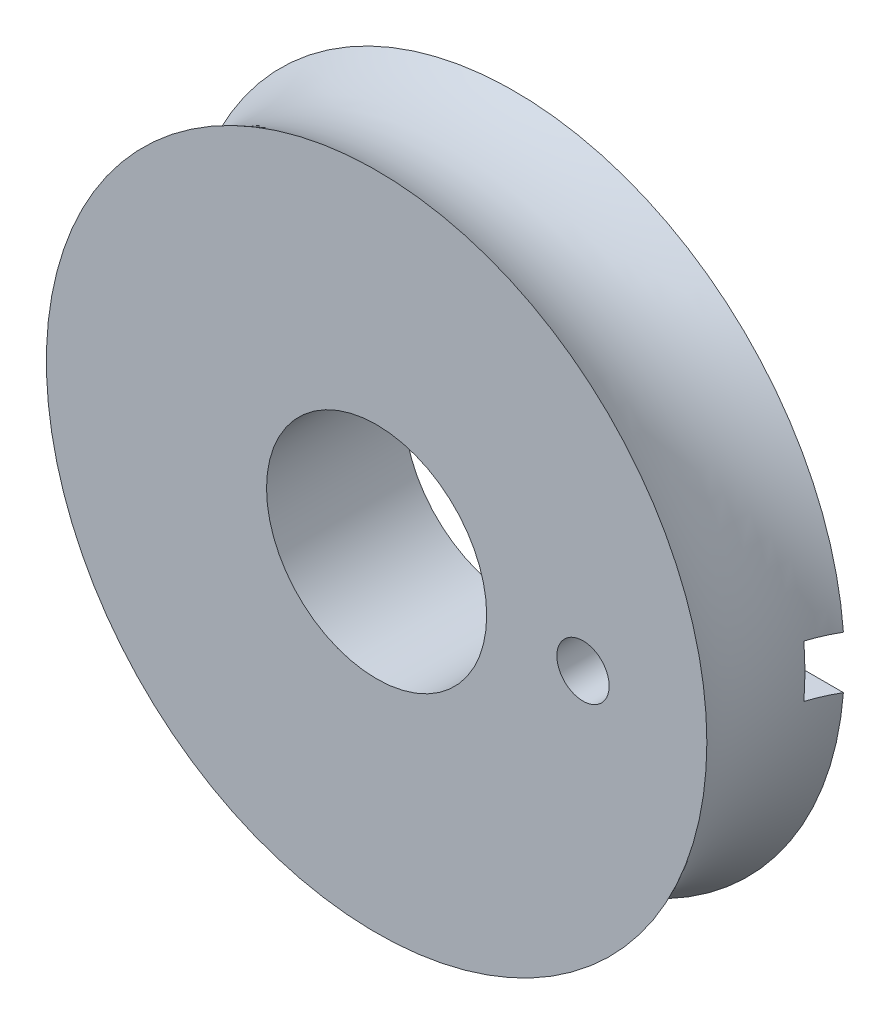
ISO-10303-21;
HEADER;
FILE_DESCRIPTION(('STEP AP214'),'2;1');
FILE_NAME('part.step','',(''),(''),'','','');
FILE_SCHEMA(('AUTOMOTIVE_DESIGN { 1 0 10303 214 1 1 1 1 }'));
ENDSEC;
DATA;
#1=APPLICATION_CONTEXT('core data for automotive mechanical design processes');
#2=APPLICATION_PROTOCOL_DEFINITION('international standard','automotive_design',2000,#1);
#3=PRODUCT_CONTEXT('',#1,'mechanical');
#4=PRODUCT('Part','Part','',(#3));
#5=PRODUCT_RELATED_PRODUCT_CATEGORY('part','',(#4));
#6=PRODUCT_DEFINITION_FORMATION('','',#4);
#7=PRODUCT_DEFINITION_CONTEXT('part definition',#1,'design');
#8=PRODUCT_DEFINITION('design','',#6,#7);
#9=PRODUCT_DEFINITION_SHAPE('','',#8);
#10=(LENGTH_UNIT() NAMED_UNIT(*) SI_UNIT(.MILLI.,.METRE.));
#11=(NAMED_UNIT(*) PLANE_ANGLE_UNIT() SI_UNIT($,.RADIAN.));
#12=(NAMED_UNIT(*) SI_UNIT($,.STERADIAN.) SOLID_ANGLE_UNIT());
#13=UNCERTAINTY_MEASURE_WITH_UNIT(LENGTH_MEASURE(1.E-05),#10,'distance_accuracy_value','');
#14=(GEOMETRIC_REPRESENTATION_CONTEXT(3) GLOBAL_UNCERTAINTY_ASSIGNED_CONTEXT((#13)) GLOBAL_UNIT_ASSIGNED_CONTEXT((#10,
#11,#12)) REPRESENTATION_CONTEXT('',''));
#15=CARTESIAN_POINT('',(0.,0.,0.));
#16=DIRECTION('',(0.,0.,1.));
#17=DIRECTION('',(1.,0.,0.));
#18=AXIS2_PLACEMENT_3D('',#15,#16,#17);
#19=CARTESIAN_POINT('',(0.,0.,0.));
#20=DIRECTION('',(0.,0.,1.));
#21=DIRECTION('',(1.,0.,0.));
#22=AXIS2_PLACEMENT_3D('',#19,#20,#21);
#23=PLANE('',#22);
#24=CARTESIAN_POINT('',(7.5,0.,0.));
#25=DIRECTION('',(0.,0.,-1.));
#26=DIRECTION('',(-1.,0.,0.));
#27=AXIS2_PLACEMENT_3D('',#24,#25,#26);
#28=CIRCLE('',#27,0.95);
#29=CARTESIAN_POINT('',(6.55,0.,0.));
#30=VERTEX_POINT('',#29);
#31=EDGE_CURVE('E154',#30,#30,#28,.T.);
#32=ORIENTED_EDGE('',*,*,#31,.T.);
#33=EDGE_LOOP('',(#32));
#34=FACE_BOUND('',#33,.T.);
#35=CARTESIAN_POINT('',(0.,0.,0.));
#36=DIRECTION('',(0.,0.,1.));
#37=DIRECTION('',(1.,0.,0.));
#38=AXIS2_PLACEMENT_3D('',#35,#36,#37);
#39=CIRCLE('',#38,4.);
#40=CARTESIAN_POINT('',(4.,0.,0.));
#41=VERTEX_POINT('',#40);
#42=EDGE_CURVE('E158',#41,#41,#39,.T.);
#43=ORIENTED_EDGE('',*,*,#42,.F.);
#44=EDGE_LOOP('',(#43));
#45=FACE_BOUND('',#44,.T.);
#46=CARTESIAN_POINT('',(0.,0.,0.));
#47=DIRECTION('',(0.,0.,1.));
#48=DIRECTION('',(1.,0.,0.));
#49=AXIS2_PLACEMENT_3D('',#46,#47,#48);
#50=CIRCLE('',#49,12.);
#51=CARTESIAN_POINT('',(12.,0.,0.));
#52=VERTEX_POINT('',#51);
#53=EDGE_CURVE('E51',#52,#52,#50,.T.);
#54=ORIENTED_EDGE('',*,*,#53,.T.);
#55=EDGE_LOOP('',(#54));
#56=FACE_BOUND('',#55,.T.);
#57=ADVANCED_FACE('F43',(#34,#45,#56),#23,.T.);
#58=CARTESIAN_POINT('',(0.,0.,-2.5));
#59=DIRECTION('',(0.,0.,1.));
#60=DIRECTION('',(1.,0.,0.));
#61=AXIS2_PLACEMENT_3D('',#58,#59,#60);
#62=TOROIDAL_SURFACE('',#61,16.3301270189222,5.);
#63=CARTESIAN_POINT('',(16.6099722286464,0.95,-7.49056678825223));
#64=CARTESIAN_POINT('',(16.4690856211627,0.95,-7.49923427007496));
#65=CARTESIAN_POINT('',(16.3278344244508,0.95,-7.5019251202439));
#66=CARTESIAN_POINT('',(16.0456139038778,0.95,-7.49540420740135));
#67=CARTESIAN_POINT('',(15.9046445659456,0.95,-7.48619305422756));
#68=CARTESIAN_POINT('',(15.6240831041017,0.95,-7.45593033397462));
#69=CARTESIAN_POINT('',(15.4844900793214,0.95,-7.43488711894718));
#70=CARTESIAN_POINT('',(15.2075730803796,0.95,-7.38112275664109));
#71=CARTESIAN_POINT('',(15.0702490813083,0.95,-7.34840173765229));
#72=CARTESIAN_POINT('',(14.7988070382839,0.95,-7.27150344620997));
#73=CARTESIAN_POINT('',(14.6646898679316,0.95,-7.22732308999076));
#74=CARTESIAN_POINT('',(14.4006038506592,0.95,-7.12780604850254));
#75=CARTESIAN_POINT('',(14.2706365548161,0.95,-7.07246524710585));
#76=CARTESIAN_POINT('',(14.015897288491,0.95,-6.95106322844596));
#77=CARTESIAN_POINT('',(13.8911224928323,0.95,-6.88500793922445));
#78=CARTESIAN_POINT('',(13.647535059338,0.95,-6.7425959385003));
#79=CARTESIAN_POINT('',(13.5287246385344,0.95,-6.66623543475621));
#80=CARTESIAN_POINT('',(13.297994998553,0.95,-6.5037940511035));
#81=CARTESIAN_POINT('',(13.1860738795521,0.95,-6.41771586970767));
#82=CARTESIAN_POINT('',(12.9698469392136,0.95,-6.23639652543564));
#83=CARTESIAN_POINT('',(12.8655439487237,0.95,-6.14115198656342));
#84=CARTESIAN_POINT('',(12.665371450766,0.95,-5.94222451963951));
#85=CARTESIAN_POINT('',(12.5694999246896,0.95,-5.83854362287484));
#86=CARTESIAN_POINT('',(12.3868186502065,0.95,-5.62341797101158));
#87=CARTESIAN_POINT('',(12.3000122552596,0.95,-5.51197036802029));
#88=CARTESIAN_POINT('',(12.1362926945604,0.95,-5.2823650891307));
#89=CARTESIAN_POINT('',(12.0593602237172,0.95,-5.16422117864825));
#90=CARTESIAN_POINT('',(11.9157173785261,0.95,-4.92181523280993));
#91=CARTESIAN_POINT('',(11.8490107908879,0.95,-4.79755095344081));
#92=CARTESIAN_POINT('',(11.7263645241591,0.95,-4.54387900555786));
#93=CARTESIAN_POINT('',(11.6704205135286,0.95,-4.4144734316313));
#94=CARTESIAN_POINT('',(11.5696560417951,0.95,-4.15134925185179));
#95=CARTESIAN_POINT('',(11.5248396826375,0.95,-4.01762907598657));
#96=CARTESIAN_POINT('',(11.4468182761218,0.95,-3.74731626172265));
#97=CARTESIAN_POINT('',(11.4135750033541,0.95,-3.61073469029973));
#98=CARTESIAN_POINT('',(11.358721881655,0.95,-3.33524110723653));
#99=CARTESIAN_POINT('',(11.3371163366668,0.95,-3.19632825298269));
#100=CARTESIAN_POINT('',(11.2900766665793,0.95,-2.77769517325149));
#101=CARTESIAN_POINT('',(11.2823295190018,0.95,-2.49576768339198));
#102=CARTESIAN_POINT('',(11.3143754784574,0.95,-1.93544305569458));
#103=CARTESIAN_POINT('',(11.3540588963338,0.95,-1.65703927124092));
#104=CARTESIAN_POINT('',(11.479589436482,0.95,-1.11080942822649));
#105=CARTESIAN_POINT('',(11.5654315759903,0.95,-0.842982231288412));
#106=CARTESIAN_POINT('',(11.762252549476,0.95,-0.370024981867192));
#107=CARTESIAN_POINT('',(11.8663828220489,0.95,-0.162026626241924));
#108=CARTESIAN_POINT('',(12.0433334961672,0.95,0.137456885273732));
#109=CARTESIAN_POINT('',(12.1057700766582,0.95,0.23519127697452));
#110=CARTESIAN_POINT('',(12.23728524194,0.95,0.426104183005245));
#111=CARTESIAN_POINT('',(12.3063647477378,0.95,0.519282062889144));
#112=CARTESIAN_POINT('',(12.3786182842567,0.95,0.609972228646443));
#113=B_SPLINE_CURVE_WITH_KNOTS('',3,(#63,#64,#65,#66,#67,#68,#69,#70,#71,#72,#73,#74,#75,#76,
#77,#78,#79,#80,#81,#82,#83,#84,#85,#86,#87,#88,#89,#90,#91,#92,#93,#94,#95,#96,#97,#98,#99,
#100,#101,#102,#103,#104,#105,#106,#107,#108,#109,#110,#111,#112),.UNSPECIFIED.,.F.,.F.,(4,2,2,
2,2,2,2,2,2,2,2,2,2,2,2,2,2,2,2,2,2,2,2,2,4),(0.,0.423329137291033,0.846636584802267,
1.26964560121558,1.69264997068571,2.11576829109022,2.53904294975978,2.96208421562806,
3.38528158416787,3.80836172228918,4.23159828275148,4.65473323713003,5.07802417122917,
5.5004744708454,5.92308083056536,6.34551674937264,6.76810815876421,7.18929022048912,
7.61062793985432,8.4523394299958,9.29210811682564,10.1317861700992,10.8272624716086,
11.1749415265617,11.5226688550988),.UNSPECIFIED.);
#114=CARTESIAN_POINT('',(11.9623367282484,0.95,-5.));
#115=VERTEX_POINT('',#114);
#116=CARTESIAN_POINT('',(11.5213308770929,0.95,-4.));
#117=VERTEX_POINT('',#116);
#118=EDGE_CURVE('E93',#115,#117,#113,.T.);
#119=ORIENTED_EDGE('',*,*,#118,.F.);
#120=CARTESIAN_POINT('',(0.,0.,-5.));
#121=DIRECTION('',(0.,0.,1.));
#122=DIRECTION('',(1.,0.,0.));
#123=AXIS2_PLACEMENT_3D('',#120,#121,#122);
#124=CIRCLE('',#123,12.);
#125=CARTESIAN_POINT('',(11.9623367282484,-0.95,-5.));
#126=VERTEX_POINT('',#125);
#127=EDGE_CURVE('E163',#115,#126,#124,.T.);
#128=ORIENTED_EDGE('',*,*,#127,.T.);
#129=CARTESIAN_POINT('',(12.3786182842567,-0.95,0.609972228646444));
#130=CARTESIAN_POINT('',(12.2910903214755,-0.95,0.500131405212451));
#131=CARTESIAN_POINT('',(12.2082091069875,-0.95,0.386590198513671));
#132=CARTESIAN_POINT('',(12.0522838430119,-0.95,0.152947889496803));
#133=CARTESIAN_POINT('',(11.9792394818985,-0.95,0.0328469951553883));
#134=CARTESIAN_POINT('',(11.8435677735349,-0.95,-0.213005146384381));
#135=CARTESIAN_POINT('',(11.7809340376919,-0.95,-0.338752867712755));
#136=CARTESIAN_POINT('',(11.6664793692499,-0.95,-0.595074089997886));
#137=CARTESIAN_POINT('',(11.6146582569239,-0.95,-0.725647510699612));
#138=CARTESIAN_POINT('',(11.5221882633574,-0.95,-0.990746746520783));
#139=CARTESIAN_POINT('',(11.4815435249747,-0.95,-1.12527400685157));
#140=CARTESIAN_POINT('',(11.4117355444093,-0.95,-1.39732844735223));
#141=CARTESIAN_POINT('',(11.382576550556,-0.95,-1.53485671771803));
#142=CARTESIAN_POINT('',(11.3359895581455,-0.95,-1.81180092900116));
#143=CARTESIAN_POINT('',(11.3185545114975,-0.95,-1.95121568429713));
#144=CARTESIAN_POINT('',(11.2955111267111,-0.95,-2.23107115704392));
#145=CARTESIAN_POINT('',(11.2899071496162,-0.95,-2.37151223367198));
#146=CARTESIAN_POINT('',(11.2905793697296,-0.95,-2.65205520503905));
#147=CARTESIAN_POINT('',(11.2968293382758,-0.95,-2.79215716342164));
#148=CARTESIAN_POINT('',(11.321116371386,-0.95,-3.07138780553821));
#149=CARTESIAN_POINT('',(11.3391577817453,-0.95,-3.21051611131255));
#150=CARTESIAN_POINT('',(11.3868943381546,-0.95,-3.48672620212138));
#151=CARTESIAN_POINT('',(11.4165868444923,-0.95,-3.6238084434218));
#152=CARTESIAN_POINT('',(11.487421958212,-0.95,-3.89503598865364));
#153=CARTESIAN_POINT('',(11.5285687941854,-0.95,-4.02918018818352));
#154=CARTESIAN_POINT('',(11.6219838238937,-0.95,-4.29345949970675));
#155=CARTESIAN_POINT('',(11.6742461957451,-0.95,-4.4235966697363));
#156=CARTESIAN_POINT('',(11.7895475182244,-0.95,-4.67906344340828));
#157=CARTESIAN_POINT('',(11.8525904339646,-0.95,-4.80439125731602));
#158=CARTESIAN_POINT('',(11.9889592530993,-0.95,-5.04925916816724));
#159=CARTESIAN_POINT('',(12.0622812119643,-0.95,-5.16880146171281));
#160=CARTESIAN_POINT('',(12.2187261020892,-0.95,-5.40135164987128));
#161=CARTESIAN_POINT('',(12.3018526487991,-0.95,-5.51435711098381));
#162=CARTESIAN_POINT('',(12.4774985157544,-0.95,-5.73324503296186));
#163=CARTESIAN_POINT('',(12.5700384086748,-0.95,-5.83911101360963));
#164=CARTESIAN_POINT('',(12.7636879337416,-0.95,-6.04271140425752));
#165=CARTESIAN_POINT('',(12.8648007237773,-0.95,-6.14044279132059));
#166=CARTESIAN_POINT('',(13.179876028395,-0.95,-6.42028086258136));
#167=CARTESIAN_POINT('',(13.4057711811253,-0.95,-6.58927483642713));
#168=CARTESIAN_POINT('',(13.8832316614041,-0.95,-6.88745738317094));
#169=CARTESIAN_POINT('',(14.1348718449736,-0.95,-7.01652522279053));
#170=CARTESIAN_POINT('',(14.6562503413705,-0.95,-7.23066377131985));
#171=CARTESIAN_POINT('',(14.9259865891247,-0.95,-7.315739490874));
#172=CARTESIAN_POINT('',(15.431648892815,-0.95,-7.42951582745704));
#173=CARTESIAN_POINT('',(15.6660444200505,-0.95,-7.46507780210152));
#174=CARTESIAN_POINT('',(16.0194335809589,-0.95,-7.49340601727855));
#175=CARTESIAN_POINT('',(16.1375287316119,-0.95,-7.49867966451798));
#176=CARTESIAN_POINT('',(16.3738139107004,-0.95,-7.50088377767255));
#177=CARTESIAN_POINT('',(16.4920039503697,-0.95,-7.49781303928592));
#178=CARTESIAN_POINT('',(16.6099722286464,-0.95,-7.49056678825223));
#179=B_SPLINE_CURVE_WITH_KNOTS('',3,(#129,#130,#131,#132,#133,#134,#135,#136,#137,#138,#139,
#140,#141,#142,#143,#144,#145,#146,#147,#148,#149,#150,#151,#152,#153,#154,#155,#156,#157,#158,
#159,#160,#161,#162,#163,#164,#165,#166,#167,#168,#169,#170,#171,#172,#173,#174,#175,#176,#177,
#178),.UNSPECIFIED.,.F.,.F.,(4,2,2,2,2,2,2,2,2,2,2,2,2,2,2,2,2,2,2,2,2,2,2,2,4),(0.,
0.421222785962442,0.842432224686054,1.26338222166934,1.6843252210833,2.10542404592739,
2.5266784802296,2.94767944186855,3.36883556135125,3.7890608957114,4.20944119364191,
4.62972630371103,5.05016677653642,5.47038757897724,5.89076327347846,6.31097809033156,
6.73134834906747,7.15265790522582,7.57412333374975,8.41612902300512,9.26065652388813,
10.1050878130039,10.8138505287042,11.1682286225732,11.5226578647062),.UNSPECIFIED.);
#180=CARTESIAN_POINT('',(11.5213308770929,-0.95,-4.));
#181=VERTEX_POINT('',#180);
#182=EDGE_CURVE('E104',#181,#126,#179,.T.);
#183=ORIENTED_EDGE('',*,*,#182,.F.);
#184=CARTESIAN_POINT('',(0.,0.,-4.));
#185=DIRECTION('',(0.,0.,1.));
#186=DIRECTION('',(1.,0.,0.));
#187=AXIS2_PLACEMENT_3D('',#184,#185,#186);
#188=CIRCLE('',#187,11.5604310118375);
#189=EDGE_CURVE('E65',#181,#117,#188,.T.);
#190=ORIENTED_EDGE('',*,*,#189,.T.);
#191=EDGE_LOOP('',(#119,#128,#183,#190));
#192=FACE_BOUND('',#191,.T.);
#193=ORIENTED_EDGE('',*,*,#53,.F.);
#194=EDGE_LOOP('',(#193));
#195=FACE_BOUND('',#194,.T.);
#196=ADVANCED_FACE('F124',(#192,#195),#62,.F.);
#197=CARTESIAN_POINT('',(0.,0.,-5.));
#198=DIRECTION('',(0.,0.,-1.));
#199=DIRECTION('',(-1.,0.,0.));
#200=AXIS2_PLACEMENT_3D('',#197,#198,#199);
#201=PLANE('',#200);
#202=DIRECTION('',(1.,0.,0.));
#203=VECTOR('',#202,1.);
#204=CARTESIAN_POINT('',(12.5,0.95,-5.));
#205=LINE('',#204,#203);
#206=CARTESIAN_POINT('',(7.5,0.95,-5.));
#207=VERTEX_POINT('',#206);
#208=EDGE_CURVE('E108',#207,#115,#205,.T.);
#209=ORIENTED_EDGE('',*,*,#208,.F.);
#210=CARTESIAN_POINT('',(7.5,0.,-5.));
#211=DIRECTION('',(0.,0.,-1.));
#212=DIRECTION('',(-1.,0.,0.));
#213=AXIS2_PLACEMENT_3D('',#210,#211,#212);
#214=CIRCLE('',#213,0.95);
#215=CARTESIAN_POINT('',(7.5,-0.95,-5.));
#216=VERTEX_POINT('',#215);
#217=EDGE_CURVE('E99',#216,#207,#214,.T.);
#218=ORIENTED_EDGE('',*,*,#217,.F.);
#219=DIRECTION('',(-1.,0.,0.));
#220=VECTOR('',#219,1.);
#221=CARTESIAN_POINT('',(12.5,-0.95,-5.));
#222=LINE('',#221,#220);
#223=EDGE_CURVE('E182',#126,#216,#222,.T.);
#224=ORIENTED_EDGE('',*,*,#223,.F.);
#225=ORIENTED_EDGE('',*,*,#127,.F.);
#226=EDGE_LOOP('',(#209,#218,#224,#225));
#227=FACE_BOUND('',#226,.T.);
#228=CARTESIAN_POINT('',(0.,0.,-5.));
#229=DIRECTION('',(0.,0.,-1.));
#230=DIRECTION('',(-1.,0.,0.));
#231=AXIS2_PLACEMENT_3D('',#228,#229,#230);
#232=CIRCLE('',#231,4.);
#233=CARTESIAN_POINT('',(-4.,0.,-5.));
#234=VERTEX_POINT('',#233);
#235=EDGE_CURVE('E170',#234,#234,#232,.T.);
#236=ORIENTED_EDGE('',*,*,#235,.F.);
#237=EDGE_LOOP('',(#236));
#238=FACE_BOUND('',#237,.T.);
#239=ADVANCED_FACE('F138',(#227,#238),#201,.T.);
#240=CARTESIAN_POINT('',(0.,0.,5.));
#241=DIRECTION('',(0.,0.,-1.));
#242=DIRECTION('',(-1.,0.,0.));
#243=AXIS2_PLACEMENT_3D('',#240,#241,#242);
#244=CYLINDRICAL_SURFACE('',#243,4.);
#245=ORIENTED_EDGE('',*,*,#42,.T.);
#246=EDGE_LOOP('',(#245));
#247=FACE_BOUND('',#246,.T.);
#248=ORIENTED_EDGE('',*,*,#235,.T.);
#249=EDGE_LOOP('',(#248));
#250=FACE_BOUND('',#249,.T.);
#251=ADVANCED_FACE('F135',(#247,#250),#244,.F.);
#252=CARTESIAN_POINT('',(7.5,0.,0.));
#253=DIRECTION('',(0.,0.,-1.));
#254=DIRECTION('',(-1.,0.,0.));
#255=AXIS2_PLACEMENT_3D('',#252,#253,#254);
#256=CYLINDRICAL_SURFACE('',#255,0.95);
#257=ORIENTED_EDGE('',*,*,#31,.F.);
#258=EDGE_LOOP('',(#257));
#259=FACE_BOUND('',#258,.T.);
#260=ORIENTED_EDGE('',*,*,#217,.T.);
#261=DIRECTION('',(0.,0.,-1.));
#262=VECTOR('',#261,1.);
#263=CARTESIAN_POINT('',(7.5,0.95,-4.));
#264=LINE('',#263,#262);
#265=CARTESIAN_POINT('',(7.5,0.95,-4.));
#266=VERTEX_POINT('',#265);
#267=EDGE_CURVE('E90',#266,#207,#264,.T.);
#268=ORIENTED_EDGE('',*,*,#267,.F.);
#269=CARTESIAN_POINT('',(7.5,0.,-4.));
#270=DIRECTION('',(0.,0.,-1.));
#271=DIRECTION('',(-1.,0.,0.));
#272=AXIS2_PLACEMENT_3D('',#269,#270,#271);
#273=CIRCLE('',#272,0.95);
#274=CARTESIAN_POINT('',(7.5,-0.95,-4.));
#275=VERTEX_POINT('',#274);
#276=EDGE_CURVE('E11',#275,#266,#273,.F.);
#277=ORIENTED_EDGE('',*,*,#276,.F.);
#278=DIRECTION('',(0.,0.,-1.));
#279=VECTOR('',#278,1.);
#280=CARTESIAN_POINT('',(7.5,-0.95,-4.));
#281=LINE('',#280,#279);
#282=EDGE_CURVE('E58',#275,#216,#281,.T.);
#283=ORIENTED_EDGE('',*,*,#282,.T.);
#284=EDGE_LOOP('',(#260,#268,#277,#283));
#285=FACE_BOUND('',#284,.T.);
#286=ADVANCED_FACE('F97',(#259,#285),#256,.F.);
#287=CARTESIAN_POINT('',(0.,0.,-4.));
#288=DIRECTION('',(0.,0.,-1.));
#289=DIRECTION('',(-1.,0.,0.));
#290=AXIS2_PLACEMENT_3D('',#287,#288,#289);
#291=PLANE('',#290);
#292=DIRECTION('',(-1.,0.,0.));
#293=VECTOR('',#292,1.);
#294=CARTESIAN_POINT('',(12.5,-0.95,-4.));
#295=LINE('',#294,#293);
#296=EDGE_CURVE('E85',#181,#275,#295,.T.);
#297=ORIENTED_EDGE('',*,*,#296,.T.);
#298=ORIENTED_EDGE('',*,*,#276,.T.);
#299=DIRECTION('',(1.,0.,0.));
#300=VECTOR('',#299,1.);
#301=CARTESIAN_POINT('',(12.5,0.95,-4.));
#302=LINE('',#301,#300);
#303=EDGE_CURVE('E84',#266,#117,#302,.T.);
#304=ORIENTED_EDGE('',*,*,#303,.T.);
#305=ORIENTED_EDGE('',*,*,#189,.F.);
#306=EDGE_LOOP('',(#297,#298,#304,#305));
#307=FACE_BOUND('',#306,.T.);
#308=ADVANCED_FACE('F83',(#307),#291,.T.);
#309=CARTESIAN_POINT('',(12.5,0.95,-4.));
#310=DIRECTION('',(0.,1.,0.));
#311=DIRECTION('',(0.,0.,1.));
#312=AXIS2_PLACEMENT_3D('',#309,#310,#311);
#313=PLANE('',#312);
#314=ORIENTED_EDGE('',*,*,#118,.T.);
#315=ORIENTED_EDGE('',*,*,#303,.F.);
#316=ORIENTED_EDGE('',*,*,#267,.T.);
#317=ORIENTED_EDGE('',*,*,#208,.T.);
#318=EDGE_LOOP('',(#314,#315,#316,#317));
#319=FACE_BOUND('',#318,.T.);
#320=ADVANCED_FACE('F89',(#319),#313,.F.);
#321=CARTESIAN_POINT('',(12.5,-0.95,-4.));
#322=DIRECTION('',(0.,-1.,0.));
#323=DIRECTION('',(1.,0.,0.));
#324=AXIS2_PLACEMENT_3D('',#321,#322,#323);
#325=PLANE('',#324);
#326=ORIENTED_EDGE('',*,*,#182,.T.);
#327=ORIENTED_EDGE('',*,*,#223,.T.);
#328=ORIENTED_EDGE('',*,*,#282,.F.);
#329=ORIENTED_EDGE('',*,*,#296,.F.);
#330=EDGE_LOOP('',(#326,#327,#328,#329));
#331=FACE_BOUND('',#330,.T.);
#332=ADVANCED_FACE('F127',(#331),#325,.F.);
#333=CLOSED_SHELL('',(#57,#196,#239,#251,#286,#308,#320,#332));
#334=MANIFOLD_SOLID_BREP('B2',#333);
#335=ADVANCED_BREP_SHAPE_REPRESENTATION('',(#18,#334),#14);
#336=SHAPE_DEFINITION_REPRESENTATION(#9,#335);
ENDSEC;
END-ISO-10303-21;
